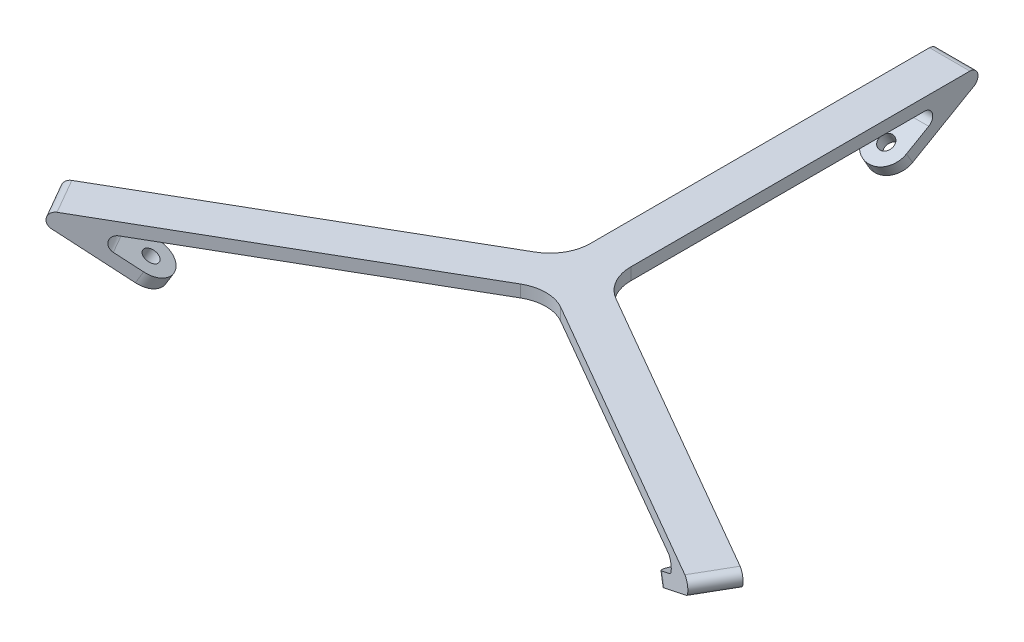
ISO-10303-21;
HEADER;
FILE_DESCRIPTION(('STEP AP214'),'2;1');
FILE_NAME('part.step','',(''),(''),'','','');
FILE_SCHEMA(('AUTOMOTIVE_DESIGN { 1 0 10303 214 1 1 1 1 }'));
ENDSEC;
DATA;
#1=APPLICATION_CONTEXT('core data for automotive mechanical design processes');
#2=APPLICATION_PROTOCOL_DEFINITION('international standard','automotive_design',2000,#1);
#3=PRODUCT_CONTEXT('',#1,'mechanical');
#4=PRODUCT('Part','Part','',(#3));
#5=PRODUCT_RELATED_PRODUCT_CATEGORY('part','',(#4));
#6=PRODUCT_DEFINITION_FORMATION('','',#4);
#7=PRODUCT_DEFINITION_CONTEXT('part definition',#1,'design');
#8=PRODUCT_DEFINITION('design','',#6,#7);
#9=PRODUCT_DEFINITION_SHAPE('','',#8);
#10=(LENGTH_UNIT() NAMED_UNIT(*) SI_UNIT(.MILLI.,.METRE.));
#11=(NAMED_UNIT(*) PLANE_ANGLE_UNIT() SI_UNIT($,.RADIAN.));
#12=(NAMED_UNIT(*) SI_UNIT($,.STERADIAN.) SOLID_ANGLE_UNIT());
#13=UNCERTAINTY_MEASURE_WITH_UNIT(LENGTH_MEASURE(1.E-05),#10,'distance_accuracy_value','');
#14=(GEOMETRIC_REPRESENTATION_CONTEXT(3) GLOBAL_UNCERTAINTY_ASSIGNED_CONTEXT((#13)) GLOBAL_UNIT_ASSIGNED_CONTEXT((#10,
#11,#12)) REPRESENTATION_CONTEXT('',''));
#15=CARTESIAN_POINT('',(0.,0.,0.));
#16=DIRECTION('',(0.,0.,1.));
#17=DIRECTION('',(1.,0.,0.));
#18=AXIS2_PLACEMENT_3D('',#15,#16,#17);
#19=CARTESIAN_POINT('',(152.180128674979,15.,-63.5837147674319));
#20=DIRECTION('',(-0.433012701892214,0.866025403784442,-0.249999999999999));
#21=DIRECTION('',(-0.894427190999919,-0.447213595499952,0.));
#22=AXIS2_PLACEMENT_3D('',#19,#20,#21);
#23=PLANE('',#22);
#24=CARTESIAN_POINT('',(67.8525403784434,2.49999999999997,39.1746824526945));
#25=DIRECTION('',(-0.433012701892214,0.866025403784442,-0.249999999999999));
#26=DIRECTION('',(-0.894427190999919,-0.447213595499952,0.));
#27=AXIS2_PLACEMENT_3D('',#24,#25,#26);
#28=CIRCLE('',#27,5.);
#29=CARTESIAN_POINT('',(65.3525403784434,2.49999999999997,43.5048094716167));
#30=VERTEX_POINT('',#29);
#31=CARTESIAN_POINT('',(64.1025403784434,0.,37.0096189432335));
#32=VERTEX_POINT('',#31);
#33=EDGE_CURVE('E380',#30,#32,#28,.F.);
#34=ORIENTED_EDGE('',*,*,#33,.T.);
#35=CARTESIAN_POINT('',(67.8525403784434,2.49999999999997,39.1746824526945));
#36=DIRECTION('',(-0.433012701892214,0.866025403784442,-0.249999999999999));
#37=DIRECTION('',(-0.894427190999919,-0.447213595499952,0.));
#38=AXIS2_PLACEMENT_3D('',#35,#36,#37);
#39=CIRCLE('',#38,5.);
#40=CARTESIAN_POINT('',(70.3525403784434,2.49999999999997,34.8445554337723));
#41=VERTEX_POINT('',#40);
#42=EDGE_CURVE('E383',#32,#41,#39,.F.);
#43=ORIENTED_EDGE('',*,*,#42,.T.);
#44=DIRECTION('',(0.750000000000001,0.499999999999995,0.433012701892224));
#45=VECTOR('',#44,1.);
#46=CARTESIAN_POINT('',(89.1025403784437,15.,45.6698729810781));
#47=LINE('',#46,#45);
#48=CARTESIAN_POINT('',(83.5044641670903,11.2679491924311,42.4378221735091));
#49=VERTEX_POINT('',#48);
#50=EDGE_CURVE('E504',#41,#49,#47,.T.);
#51=ORIENTED_EDGE('',*,*,#50,.T.);
#52=DIRECTION('',(0.500000000000004,0.,-0.866025403784436));
#53=VECTOR('',#52,1.);
#54=CARTESIAN_POINT('',(146.582052463626,11.2679491924311,-66.8157655750008));
#55=LINE('',#54,#53);
#56=CARTESIAN_POINT('',(78.5044641670903,11.2679491924311,51.0980762113535));
#57=VERTEX_POINT('',#56);
#58=EDGE_CURVE('E308',#49,#57,#55,.F.);
#59=ORIENTED_EDGE('',*,*,#58,.T.);
#60=DIRECTION('',(-0.750000000000001,-0.499999999999995,-0.433012701892224));
#61=VECTOR('',#60,1.);
#62=CARTESIAN_POINT('',(84.1025403784436,15.,54.3301270189225));
#63=LINE('',#62,#61);
#64=EDGE_CURVE('E509',#57,#30,#63,.T.);
#65=ORIENTED_EDGE('',*,*,#64,.T.);
#66=EDGE_LOOP('',(#34,#43,#51,#59,#65));
#67=FACE_BOUND('',#66,.T.);
#68=CARTESIAN_POINT('',(67.8525403784434,2.49999999999999,39.1746824526946));
#69=DIRECTION('',(0.433012701892214,-0.866025403784442,0.249999999999999));
#70=DIRECTION('',(0.894427190999919,0.447213595499952,0.));
#71=AXIS2_PLACEMENT_3D('',#68,#69,#70);
#72=CIRCLE('',#71,1.79999999999998);
#73=CARTESIAN_POINT('',(69.4625093222432,3.3049844718999,39.1746824526946));
#74=VERTEX_POINT('',#73);
#75=EDGE_CURVE('E536',#74,#74,#72,.T.);
#76=ORIENTED_EDGE('',*,*,#75,.F.);
#77=EDGE_LOOP('',(#76));
#78=FACE_BOUND('',#77,.T.);
#79=ADVANCED_FACE('F45',(#67,#78),#23,.F.);
#80=CARTESIAN_POINT('',(4.99999999999988,15.,-100.));
#81=DIRECTION('',(-1.,0.,0.));
#82=DIRECTION('',(0.,0.,1.));
#83=AXIS2_PLACEMENT_3D('',#80,#81,#82);
#84=PLANE('',#83);
#85=DIRECTION('',(0.,0.499999999999995,-0.866025403784442));
#86=VECTOR('',#85,1.);
#87=CARTESIAN_POINT('',(4.99999999999987,12.,-88.8038475772932));
#88=LINE('',#87,#86);
#89=CARTESIAN_POINT('',(4.99999999999987,5.09807621135329,-76.8493649053887));
#90=VERTEX_POINT('',#89);
#91=CARTESIAN_POINT('',(4.99999999999987,8.26794919243112,-82.3397459621553));
#92=VERTEX_POINT('',#91);
#93=EDGE_CURVE('E255',#90,#92,#88,.T.);
#94=ORIENTED_EDGE('',*,*,#93,.F.);
#95=DIRECTION('',(0.,0.866025403784439,0.5));
#96=VECTOR('',#95,1.);
#97=CARTESIAN_POINT('',(4.99999999999988,2.49999999999985,-78.3493649053887));
#98=LINE('',#97,#96);
#99=CARTESIAN_POINT('',(4.99999999999987,2.49999999999998,-78.3493649053887));
#100=VERTEX_POINT('',#99);
#101=EDGE_CURVE('E11',#90,#100,#98,.F.);
#102=ORIENTED_EDGE('',*,*,#101,.T.);
#103=DIRECTION('',(0.,-0.499999999999995,0.866025403784441));
#104=VECTOR('',#103,1.);
#105=CARTESIAN_POINT('',(4.99999999999987,15.,-100.));
#106=LINE('',#105,#104);
#107=CARTESIAN_POINT('',(4.99999999999987,11.2679491924311,-93.5358983848621));
#108=VERTEX_POINT('',#107);
#109=EDGE_CURVE('E454',#108,#100,#106,.T.);
#110=ORIENTED_EDGE('',*,*,#109,.F.);
#111=CARTESIAN_POINT('',(4.99999999999988,13.,-92.5358983848621));
#112=DIRECTION('',(-1.,0.,0.));
#113=DIRECTION('',(0.,0.,1.));
#114=AXIS2_PLACEMENT_3D('',#111,#112,#113);
#115=CIRCLE('',#114,2.);
#116=CARTESIAN_POINT('',(4.99999999999988,15.,-92.5358983848621));
#117=VERTEX_POINT('',#116);
#118=EDGE_CURVE('E300',#108,#117,#115,.F.);
#119=ORIENTED_EDGE('',*,*,#118,.T.);
#120=DIRECTION('',(0.,0.,-1.));
#121=VECTOR('',#120,1.);
#122=CARTESIAN_POINT('',(4.99999999999988,15.,-100.));
#123=LINE('',#122,#121);
#124=CARTESIAN_POINT('',(4.99999999999987,15.,-8.66025403784455));
#125=VERTEX_POINT('',#124);
#126=EDGE_CURVE('E254',#125,#117,#123,.T.);
#127=ORIENTED_EDGE('',*,*,#126,.F.);
#128=DIRECTION('',(0.,-1.,0.));
#129=VECTOR('',#128,1.);
#130=CARTESIAN_POINT('',(4.99999999999987,12.,-8.66025403784455));
#131=LINE('',#130,#129);
#132=CARTESIAN_POINT('',(4.99999999999987,12.,-8.66025403784455));
#133=VERTEX_POINT('',#132);
#134=EDGE_CURVE('E252',#125,#133,#131,.T.);
#135=ORIENTED_EDGE('',*,*,#134,.T.);
#136=DIRECTION('',(0.,0.,1.));
#137=VECTOR('',#136,1.);
#138=CARTESIAN_POINT('',(4.99999999999987,12.,0.));
#139=LINE('',#138,#137);
#140=CARTESIAN_POINT('',(4.99999999999987,12.,-81.3397459621554));
#141=VERTEX_POINT('',#140);
#142=EDGE_CURVE('E240',#141,#133,#139,.T.);
#143=ORIENTED_EDGE('',*,*,#142,.F.);
#144=CARTESIAN_POINT('',(4.99999999999988,10.,-81.3397459621554));
#145=DIRECTION('',(-1.,0.,0.));
#146=DIRECTION('',(0.,0.,1.));
#147=AXIS2_PLACEMENT_3D('',#144,#145,#146);
#148=CIRCLE('',#147,2.);
#149=EDGE_CURVE('E224',#141,#92,#148,.T.);
#150=ORIENTED_EDGE('',*,*,#149,.T.);
#151=EDGE_LOOP('',(#94,#102,#110,#119,#127,#135,#143,#150));
#152=FACE_BOUND('',#151,.T.);
#153=ADVANCED_FACE('F249',(#152),#84,.F.);
#154=CARTESIAN_POINT('',(-5.00000000000013,15.,-2.88675134594818));
#155=DIRECTION('',(1.,0.,0.));
#156=DIRECTION('',(0.,0.,-1.));
#157=AXIS2_PLACEMENT_3D('',#154,#155,#156);
#158=PLANE('',#157);
#159=DIRECTION('',(0.,0.499999999999995,-0.866025403784442));
#160=VECTOR('',#159,1.);
#161=CARTESIAN_POINT('',(-5.00000000000012,15.,-100.));
#162=LINE('',#161,#160);
#163=CARTESIAN_POINT('',(-5.00000000000012,2.49999999999997,-78.3493649053887));
#164=VERTEX_POINT('',#163);
#165=CARTESIAN_POINT('',(-5.00000000000012,11.2679491924311,-93.5358983848621));
#166=VERTEX_POINT('',#165);
#167=EDGE_CURVE('E461',#164,#166,#162,.T.);
#168=ORIENTED_EDGE('',*,*,#167,.F.);
#169=DIRECTION('',(0.,-0.866025403784439,-0.5));
#170=VECTOR('',#169,1.);
#171=CARTESIAN_POINT('',(-5.00000000000012,44.5512701892217,-54.0710527418758));
#172=LINE('',#171,#170);
#173=CARTESIAN_POINT('',(-5.00000000000012,5.09807621135329,-76.8493649053887));
#174=VERTEX_POINT('',#173);
#175=EDGE_CURVE('E424',#164,#174,#172,.F.);
#176=ORIENTED_EDGE('',*,*,#175,.T.);
#177=DIRECTION('',(0.,-0.499999999999995,0.866025403784442));
#178=VECTOR('',#177,1.);
#179=CARTESIAN_POINT('',(-5.00000000000012,12.,-88.8038475772932));
#180=LINE('',#179,#178);
#181=CARTESIAN_POINT('',(-5.00000000000012,8.26794919243111,-82.3397459621553));
#182=VERTEX_POINT('',#181);
#183=EDGE_CURVE('E460',#182,#174,#180,.T.);
#184=ORIENTED_EDGE('',*,*,#183,.F.);
#185=CARTESIAN_POINT('',(-5.00000000000012,10.,-81.3397459621554));
#186=DIRECTION('',(1.,0.,0.));
#187=DIRECTION('',(0.,0.,-1.));
#188=AXIS2_PLACEMENT_3D('',#185,#186,#187);
#189=CIRCLE('',#188,2.);
#190=CARTESIAN_POINT('',(-5.00000000000012,12.,-81.3397459621554));
#191=VERTEX_POINT('',#190);
#192=EDGE_CURVE('E233',#182,#191,#189,.T.);
#193=ORIENTED_EDGE('',*,*,#192,.T.);
#194=DIRECTION('',(0.,0.,-1.));
#195=VECTOR('',#194,1.);
#196=CARTESIAN_POINT('',(-5.00000000000013,12.,0.));
#197=LINE('',#196,#195);
#198=CARTESIAN_POINT('',(-5.00000000000013,12.,-8.66025403784427));
#199=VERTEX_POINT('',#198);
#200=EDGE_CURVE('E242',#199,#191,#197,.T.);
#201=ORIENTED_EDGE('',*,*,#200,.F.);
#202=DIRECTION('',(0.,-1.,0.));
#203=VECTOR('',#202,1.);
#204=CARTESIAN_POINT('',(-5.00000000000013,15.,-8.66025403784427));
#205=LINE('',#204,#203);
#206=CARTESIAN_POINT('',(-5.00000000000013,15.,-8.66025403784427));
#207=VERTEX_POINT('',#206);
#208=EDGE_CURVE('E352',#199,#207,#205,.F.);
#209=ORIENTED_EDGE('',*,*,#208,.T.);
#210=DIRECTION('',(0.,0.,1.));
#211=VECTOR('',#210,1.);
#212=CARTESIAN_POINT('',(-5.00000000000013,15.,-2.88675134594818));
#213=LINE('',#212,#211);
#214=CARTESIAN_POINT('',(-5.00000000000012,15.,-92.5358983848621));
#215=VERTEX_POINT('',#214);
#216=EDGE_CURVE('E246',#215,#207,#213,.T.);
#217=ORIENTED_EDGE('',*,*,#216,.F.);
#218=CARTESIAN_POINT('',(-5.00000000000012,13.,-92.5358983848621));
#219=DIRECTION('',(1.,0.,0.));
#220=DIRECTION('',(0.,0.,-1.));
#221=AXIS2_PLACEMENT_3D('',#218,#219,#220);
#222=CIRCLE('',#221,2.);
#223=EDGE_CURVE('E293',#215,#166,#222,.F.);
#224=ORIENTED_EDGE('',*,*,#223,.T.);
#225=EDGE_LOOP('',(#168,#176,#184,#193,#201,#209,#217,#224));
#226=FACE_BOUND('',#225,.T.);
#227=ADVANCED_FACE('F611',(#226),#158,.F.);
#228=CARTESIAN_POINT('',(0.,15.,0.));
#229=DIRECTION('',(0.,-1.,0.));
#230=DIRECTION('',(0.,0.,-1.));
#231=AXIS2_PLACEMENT_3D('',#228,#229,#230);
#232=PLANE('',#231);
#233=DIRECTION('',(-0.866025403784436,0.,-0.500000000000004));
#234=VECTOR('',#233,1.);
#235=CARTESIAN_POINT('',(5.00000000000012,15.,-2.88675134594819));
#236=LINE('',#235,#234);
#237=CARTESIAN_POINT('',(82.6384387633059,15.,41.9378221735091));
#238=VERTEX_POINT('',#237);
#239=CARTESIAN_POINT('',(9.99999999999984,15.,-1.92120624964431E-13));
#240=VERTEX_POINT('',#239);
#241=EDGE_CURVE('E477',#238,#240,#236,.T.);
#242=ORIENTED_EDGE('',*,*,#241,.T.);
#243=CARTESIAN_POINT('',(14.9999999999999,15.,-8.66025403784455));
#244=DIRECTION('',(0.,-1.,0.));
#245=DIRECTION('',(0.,0.,-1.));
#246=AXIS2_PLACEMENT_3D('',#243,#244,#245);
#247=CIRCLE('',#246,10.);
#248=EDGE_CURVE('E365',#240,#125,#247,.T.);
#249=ORIENTED_EDGE('',*,*,#248,.T.);
#250=ORIENTED_EDGE('',*,*,#126,.T.);
#251=DIRECTION('',(-1.,0.,0.));
#252=VECTOR('',#251,1.);
#253=CARTESIAN_POINT('',(0.,15.,-92.5358983848621));
#254=LINE('',#253,#252);
#255=EDGE_CURVE('E289',#117,#215,#254,.T.);
#256=ORIENTED_EDGE('',*,*,#255,.T.);
#257=ORIENTED_EDGE('',*,*,#216,.T.);
#258=CARTESIAN_POINT('',(-15.0000000000001,15.,-8.66025403784427));
#259=DIRECTION('',(0.,-1.,0.));
#260=DIRECTION('',(0.,0.,-1.));
#261=AXIS2_PLACEMENT_3D('',#258,#259,#260);
#262=CIRCLE('',#261,10.);
#263=CARTESIAN_POINT('',(-10.0000000000002,15.,1.73472347597681E-13));
#264=VERTEX_POINT('',#263);
#265=EDGE_CURVE('E371',#207,#264,#262,.T.);
#266=ORIENTED_EDGE('',*,*,#265,.T.);
#267=DIRECTION('',(-0.866025403784443,0.,0.499999999999992));
#268=VECTOR('',#267,1.);
#269=CARTESIAN_POINT('',(-89.1025403784442,15.,45.6698729810771));
#270=LINE('',#269,#268);
#271=CARTESIAN_POINT('',(-82.6384387633063,15.,41.9378221735082));
#272=VERTEX_POINT('',#271);
#273=EDGE_CURVE('E488',#264,#272,#270,.T.);
#274=ORIENTED_EDGE('',*,*,#273,.T.);
#275=DIRECTION('',(0.499999999999992,0.,0.866025403784443));
#276=VECTOR('',#275,1.);
#277=CARTESIAN_POINT('',(-80.1384387633064,15.,46.2679491924303));
#278=LINE('',#277,#276);
#279=CARTESIAN_POINT('',(-77.6384387633064,15.,50.5980762113526));
#280=VERTEX_POINT('',#279);
#281=EDGE_CURVE('E281',#272,#280,#278,.T.);
#282=ORIENTED_EDGE('',*,*,#281,.T.);
#283=DIRECTION('',(0.866025403784443,0.,-0.499999999999992));
#284=VECTOR('',#283,1.);
#285=CARTESIAN_POINT('',(0.,15.,5.77350269189639));
#286=LINE('',#285,#284);
#287=CARTESIAN_POINT('',(-4.99999999999979,15.,8.66025403784432));
#288=VERTEX_POINT('',#287);
#289=EDGE_CURVE('E484',#280,#288,#286,.T.);
#290=ORIENTED_EDGE('',*,*,#289,.T.);
#291=CARTESIAN_POINT('',(1.2490009027033E-13,15.,17.3205080756888));
#292=DIRECTION('',(0.,-1.,0.));
#293=DIRECTION('',(0.,0.,-1.));
#294=AXIS2_PLACEMENT_3D('',#291,#292,#293);
#295=CIRCLE('',#294,10.);
#296=CARTESIAN_POINT('',(5.00000000000014,15.,8.66025403784437));
#297=VERTEX_POINT('',#296);
#298=EDGE_CURVE('E377',#288,#297,#295,.T.);
#299=ORIENTED_EDGE('',*,*,#298,.T.);
#300=DIRECTION('',(0.866025403784436,0.,0.500000000000004));
#301=VECTOR('',#300,1.);
#302=CARTESIAN_POINT('',(84.1025403784436,15.,54.3301270189225));
#303=LINE('',#302,#301);
#304=CARTESIAN_POINT('',(77.6384387633058,15.,50.5980762113535));
#305=VERTEX_POINT('',#304);
#306=EDGE_CURVE('E481',#297,#305,#303,.T.);
#307=ORIENTED_EDGE('',*,*,#306,.T.);
#308=DIRECTION('',(0.500000000000004,0.,-0.866025403784436));
#309=VECTOR('',#308,1.);
#310=CARTESIAN_POINT('',(80.1384387633058,15.,46.2679491924314));
#311=LINE('',#310,#309);
#312=EDGE_CURVE('E285',#305,#238,#311,.T.);
#313=ORIENTED_EDGE('',*,*,#312,.T.);
#314=EDGE_LOOP('',(#242,#249,#250,#256,#257,#266,#274,#282,#290,#299,#307,#313));
#315=FACE_BOUND('',#314,.T.);
#316=ADVANCED_FACE('F584',(#315),#232,.F.);
#317=CARTESIAN_POINT('',(-5.00100000000013,12.,0.));
#318=DIRECTION('',(0.,1.,0.));
#319=DIRECTION('',(0.,0.,1.));
#320=AXIS2_PLACEMENT_3D('',#317,#318,#319);
#321=PLANE('',#320);
#322=DIRECTION('',(-0.866025403784436,0.,-0.500000000000004));
#323=VECTOR('',#322,1.);
#324=CARTESIAN_POINT('',(-2.49999999999996,12.,4.33012701892207));
#325=LINE('',#324,#323);
#326=CARTESIAN_POINT('',(67.9422863405992,12.,45.0000000000001));
#327=VERTEX_POINT('',#326);
#328=CARTESIAN_POINT('',(5.00000000000017,12.,8.66025403784439));
#329=VERTEX_POINT('',#328);
#330=EDGE_CURVE('E491',#327,#329,#325,.T.);
#331=ORIENTED_EDGE('',*,*,#330,.T.);
#332=CARTESIAN_POINT('',(1.2490009027033E-13,12.,17.3205080756888));
#333=DIRECTION('',(0.,1.,0.));
#334=DIRECTION('',(0.,0.,1.));
#335=AXIS2_PLACEMENT_3D('',#332,#333,#334);
#336=CIRCLE('',#335,10.);
#337=CARTESIAN_POINT('',(-4.9999999999998,12.,8.66025403784431));
#338=VERTEX_POINT('',#337);
#339=EDGE_CURVE('E374',#329,#338,#336,.T.);
#340=ORIENTED_EDGE('',*,*,#339,.T.);
#341=DIRECTION('',(-0.866025403784443,0.,0.499999999999992));
#342=VECTOR('',#341,1.);
#343=CARTESIAN_POINT('',(2.50000000000003,12.,4.33012701892231));
#344=LINE('',#343,#342);
#345=CARTESIAN_POINT('',(-67.9422863405996,12.,44.9999999999993));
#346=VERTEX_POINT('',#345);
#347=EDGE_CURVE('E513',#338,#346,#344,.T.);
#348=ORIENTED_EDGE('',*,*,#347,.T.);
#349=DIRECTION('',(-0.499999999999992,0.,-0.866025403784443));
#350=VECTOR('',#349,1.);
#351=CARTESIAN_POINT('',(-72.9422863405995,12.,36.3397459621549));
#352=LINE('',#351,#350);
#353=CARTESIAN_POINT('',(-72.9422863405995,12.,36.3397459621549));
#354=VERTEX_POINT('',#353);
#355=EDGE_CURVE('E269',#346,#354,#352,.T.);
#356=ORIENTED_EDGE('',*,*,#355,.T.);
#357=DIRECTION('',(0.866025403784443,0.,-0.499999999999992));
#358=VECTOR('',#357,1.);
#359=CARTESIAN_POINT('',(-2.4999999999999,12.,-4.33012701892211));
#360=LINE('',#359,#358);
#361=CARTESIAN_POINT('',(-10.0000000000002,12.,1.75207071073658E-13));
#362=VERTEX_POINT('',#361);
#363=EDGE_CURVE('E505',#354,#362,#360,.T.);
#364=ORIENTED_EDGE('',*,*,#363,.T.);
#365=CARTESIAN_POINT('',(-15.0000000000001,12.,-8.66025403784427));
#366=DIRECTION('',(0.,1.,0.));
#367=DIRECTION('',(0.,0.,1.));
#368=AXIS2_PLACEMENT_3D('',#365,#366,#367);
#369=CIRCLE('',#368,10.);
#370=EDGE_CURVE('E368',#362,#199,#369,.T.);
#371=ORIENTED_EDGE('',*,*,#370,.T.);
#372=ORIENTED_EDGE('',*,*,#200,.T.);
#373=DIRECTION('',(1.,0.,0.));
#374=VECTOR('',#373,1.);
#375=CARTESIAN_POINT('',(4.99999999999987,12.,-81.3397459621554));
#376=LINE('',#375,#374);
#377=EDGE_CURVE('E228',#191,#141,#376,.T.);
#378=ORIENTED_EDGE('',*,*,#377,.T.);
#379=ORIENTED_EDGE('',*,*,#142,.T.);
#380=CARTESIAN_POINT('',(14.9999999999999,12.,-8.66025403784455));
#381=DIRECTION('',(0.,1.,0.));
#382=DIRECTION('',(0.,0.,1.));
#383=AXIS2_PLACEMENT_3D('',#380,#381,#382);
#384=CIRCLE('',#383,10.);
#385=CARTESIAN_POINT('',(9.99999999999984,12.,-1.87350135405495E-13));
#386=VERTEX_POINT('',#385);
#387=EDGE_CURVE('E362',#133,#386,#384,.T.);
#388=ORIENTED_EDGE('',*,*,#387,.T.);
#389=DIRECTION('',(0.866025403784436,0.,0.500000000000004));
#390=VECTOR('',#389,1.);
#391=CARTESIAN_POINT('',(2.50000000000009,12.,-4.33012701892228));
#392=LINE('',#391,#390);
#393=CARTESIAN_POINT('',(72.9422863405992,12.,36.3397459621557));
#394=VERTEX_POINT('',#393);
#395=EDGE_CURVE('E497',#386,#394,#392,.T.);
#396=ORIENTED_EDGE('',*,*,#395,.T.);
#397=DIRECTION('',(-0.500000000000004,0.,0.866025403784436));
#398=VECTOR('',#397,1.);
#399=CARTESIAN_POINT('',(67.9422863405991,12.,45.0000000000001));
#400=LINE('',#399,#398);
#401=EDGE_CURVE('E245',#394,#327,#400,.T.);
#402=ORIENTED_EDGE('',*,*,#401,.T.);
#403=EDGE_LOOP('',(#331,#340,#348,#356,#364,#371,#372,#378,#379,#388,#396,#402));
#404=FACE_BOUND('',#403,.T.);
#405=ADVANCED_FACE('F239',(#404),#321,.F.);
#406=CARTESIAN_POINT('',(-5.00100000000013,12.,-88.8038475772932));
#407=DIRECTION('',(0.,-0.866025403784442,-0.499999999999995));
#408=DIRECTION('',(0.,0.499999999999995,-0.866025403784442));
#409=AXIS2_PLACEMENT_3D('',#406,#407,#408);
#410=PLANE('',#409);
#411=CARTESIAN_POINT('',(0.,5.0980762113533,-76.8493649053887));
#412=DIRECTION('',(0.,-0.866025403784442,-0.499999999999995));
#413=DIRECTION('',(0.,0.499999999999995,-0.866025403784442));
#414=AXIS2_PLACEMENT_3D('',#411,#412,#413);
#415=CIRCLE('',#414,1.79999999999999);
#416=CARTESIAN_POINT('',(0.,5.99807621135329,-78.4082106322007));
#417=VERTEX_POINT('',#416);
#418=EDGE_CURVE('E466',#417,#417,#415,.T.);
#419=ORIENTED_EDGE('',*,*,#418,.T.);
#420=EDGE_LOOP('',(#419));
#421=FACE_BOUND('',#420,.T.);
#422=ORIENTED_EDGE('',*,*,#183,.T.);
#423=CARTESIAN_POINT('',(-1.24032728532342E-13,5.09807621135329,-76.8493649053887));
#424=DIRECTION('',(0.,-0.866025403784442,-0.499999999999995));
#425=DIRECTION('',(0.,0.499999999999995,-0.866025403784442));
#426=AXIS2_PLACEMENT_3D('',#423,#424,#425);
#427=CIRCLE('',#426,5.);
#428=CARTESIAN_POINT('',(-1.24032728532342E-13,2.59807621135334,-72.5192378864664));
#429=VERTEX_POINT('',#428);
#430=EDGE_CURVE('E55',#174,#429,#427,.F.);
#431=ORIENTED_EDGE('',*,*,#430,.T.);
#432=CARTESIAN_POINT('',(-1.24032728532342E-13,5.09807621135329,-76.8493649053887));
#433=DIRECTION('',(0.,-0.866025403784442,-0.499999999999995));
#434=DIRECTION('',(0.,0.499999999999995,-0.866025403784442));
#435=AXIS2_PLACEMENT_3D('',#432,#433,#434);
#436=CIRCLE('',#435,5.);
#437=EDGE_CURVE('E66',#429,#90,#436,.F.);
#438=ORIENTED_EDGE('',*,*,#437,.T.);
#439=ORIENTED_EDGE('',*,*,#93,.T.);
#440=DIRECTION('',(1.,0.,0.));
#441=VECTOR('',#440,1.);
#442=CARTESIAN_POINT('',(-5.00000000000012,8.26794919243112,-82.3397459621553));
#443=LINE('',#442,#441);
#444=EDGE_CURVE('E229',#92,#182,#443,.F.);
#445=ORIENTED_EDGE('',*,*,#444,.T.);
#446=EDGE_LOOP('',(#422,#431,#438,#439,#445));
#447=FACE_BOUND('',#446,.T.);
#448=ADVANCED_FACE('F666',(#421,#447),#410,.F.);
#449=CARTESIAN_POINT('',(-5.00100000000013,15.,-100.));
#450=DIRECTION('',(0.,0.866025403784442,0.499999999999995));
#451=DIRECTION('',(0.,-0.499999999999995,0.866025403784442));
#452=AXIS2_PLACEMENT_3D('',#449,#450,#451);
#453=PLANE('',#452);
#454=CARTESIAN_POINT('',(0.,2.49999999999999,-78.3493649053887));
#455=DIRECTION('',(0.,-0.866025403784442,-0.499999999999995));
#456=DIRECTION('',(0.,0.499999999999995,-0.866025403784442));
#457=AXIS2_PLACEMENT_3D('',#454,#455,#456);
#458=CIRCLE('',#457,1.79999999999999);
#459=CARTESIAN_POINT('',(0.,3.39999999999997,-79.9082106322006));
#460=VERTEX_POINT('',#459);
#461=EDGE_CURVE('E473',#460,#460,#458,.T.);
#462=ORIENTED_EDGE('',*,*,#461,.F.);
#463=EDGE_LOOP('',(#462));
#464=FACE_BOUND('',#463,.T.);
#465=CARTESIAN_POINT('',(-1.23992537025261E-13,2.49999999999998,-78.3493649053887));
#466=DIRECTION('',(0.,0.866025403784442,0.499999999999995));
#467=DIRECTION('',(0.,-0.499999999999995,0.866025403784442));
#468=AXIS2_PLACEMENT_3D('',#465,#466,#467);
#469=CIRCLE('',#468,5.);
#470=CARTESIAN_POINT('',(-1.24032728532342E-13,0.,-74.0192378864664));
#471=VERTEX_POINT('',#470);
#472=EDGE_CURVE('E418',#100,#471,#469,.F.);
#473=ORIENTED_EDGE('',*,*,#472,.T.);
#474=CARTESIAN_POINT('',(-1.23992537025261E-13,2.49999999999998,-78.3493649053887));
#475=DIRECTION('',(0.,0.866025403784442,0.499999999999995));
#476=DIRECTION('',(0.,-0.499999999999995,0.866025403784442));
#477=AXIS2_PLACEMENT_3D('',#474,#475,#476);
#478=CIRCLE('',#477,5.);
#479=EDGE_CURVE('E421',#471,#164,#478,.F.);
#480=ORIENTED_EDGE('',*,*,#479,.T.);
#481=ORIENTED_EDGE('',*,*,#167,.T.);
#482=DIRECTION('',(-1.,0.,0.));
#483=VECTOR('',#482,1.);
#484=CARTESIAN_POINT('',(-5.00100000000013,11.2679491924311,-93.5358983848621));
#485=LINE('',#484,#483);
#486=EDGE_CURVE('E297',#166,#108,#485,.F.);
#487=ORIENTED_EDGE('',*,*,#486,.T.);
#488=ORIENTED_EDGE('',*,*,#109,.T.);
#489=EDGE_LOOP('',(#473,#480,#481,#487,#488));
#490=FACE_BOUND('',#489,.T.);
#491=ADVANCED_FACE('F457',(#464,#490),#453,.F.);
#492=CARTESIAN_POINT('',(0.,2.49999999999999,-78.3493649053887));
#493=DIRECTION('',(0.,-0.866025403784442,-0.499999999999995));
#494=DIRECTION('',(0.,0.499999999999995,-0.866025403784442));
#495=AXIS2_PLACEMENT_3D('',#492,#493,#494);
#496=CYLINDRICAL_SURFACE('',#495,1.79999999999999);
#497=ORIENTED_EDGE('',*,*,#418,.F.);
#498=EDGE_LOOP('',(#497));
#499=FACE_BOUND('',#498,.T.);
#500=ORIENTED_EDGE('',*,*,#461,.T.);
#501=EDGE_LOOP('',(#500));
#502=FACE_BOUND('',#501,.T.);
#503=ADVANCED_FACE('F660',(#499,#502),#496,.F.);
#504=CARTESIAN_POINT('',(84.1025403784436,15.,54.3301270189225));
#505=DIRECTION('',(0.500000000000004,0.,-0.866025403784436));
#506=DIRECTION('',(-0.866025403784436,0.,-0.500000000000004));
#507=AXIS2_PLACEMENT_3D('',#504,#505,#506);
#508=PLANE('',#507);
#509=DIRECTION('',(0.750000000000001,0.499999999999995,0.433012701892224));
#510=VECTOR('',#509,1.);
#511=CARTESIAN_POINT('',(74.4063879557369,12.,48.732050807569));
#512=LINE('',#511,#510);
#513=CARTESIAN_POINT('',(64.0535022727667,5.09807621135328,42.7548094716167));
#514=VERTEX_POINT('',#513);
#515=CARTESIAN_POINT('',(68.8083117443835,8.26794919243112,45.5000000000001));
#516=VERTEX_POINT('',#515);
#517=EDGE_CURVE('E494',#514,#516,#512,.T.);
#518=ORIENTED_EDGE('',*,*,#517,.F.);
#519=DIRECTION('',(-0.433012701892218,0.866025403784438,-0.250000000000002));
#520=VECTOR('',#519,1.);
#521=CARTESIAN_POINT('',(65.3525403784435,2.49999999999983,43.5048094716168));
#522=LINE('',#521,#520);
#523=EDGE_CURVE('E396',#514,#30,#522,.F.);
#524=ORIENTED_EDGE('',*,*,#523,.T.);
#525=ORIENTED_EDGE('',*,*,#64,.F.);
#526=CARTESIAN_POINT('',(77.6384387633058,13.,50.5980762113535));
#527=DIRECTION('',(0.500000000000004,0.,-0.866025403784436));
#528=DIRECTION('',(-0.866025403784436,0.,-0.500000000000004));
#529=AXIS2_PLACEMENT_3D('',#526,#527,#528);
#530=CIRCLE('',#529,2.);
#531=EDGE_CURVE('E311',#57,#305,#530,.F.);
#532=ORIENTED_EDGE('',*,*,#531,.T.);
#533=ORIENTED_EDGE('',*,*,#306,.F.);
#534=DIRECTION('',(0.,-1.,0.));
#535=VECTOR('',#534,1.);
#536=CARTESIAN_POINT('',(5.00000000000017,12.,8.66025403784439));
#537=LINE('',#536,#535);
#538=EDGE_CURVE('E355',#297,#329,#537,.T.);
#539=ORIENTED_EDGE('',*,*,#538,.T.);
#540=ORIENTED_EDGE('',*,*,#330,.F.);
#541=CARTESIAN_POINT('',(67.9422863405991,10.,45.0000000000001));
#542=DIRECTION('',(0.500000000000004,0.,-0.866025403784436));
#543=DIRECTION('',(-0.866025403784436,0.,-0.500000000000004));
#544=AXIS2_PLACEMENT_3D('',#541,#542,#543);
#545=CIRCLE('',#544,2.);
#546=EDGE_CURVE('E334',#327,#516,#545,.T.);
#547=ORIENTED_EDGE('',*,*,#546,.T.);
#548=EDGE_LOOP('',(#518,#524,#525,#532,#533,#539,#540,#547));
#549=FACE_BOUND('',#548,.T.);
#550=ADVANCED_FACE('F587',(#549),#508,.F.);
#551=CARTESIAN_POINT('',(5.00000000000012,15.,-2.88675134594819));
#552=DIRECTION('',(-0.500000000000004,0.,0.866025403784436));
#553=DIRECTION('',(0.866025403784436,0.,0.500000000000004));
#554=AXIS2_PLACEMENT_3D('',#551,#552,#553);
#555=PLANE('',#554);
#556=ORIENTED_EDGE('',*,*,#50,.F.);
#557=DIRECTION('',(0.433012701892218,-0.866025403784438,0.250000000000002));
#558=VECTOR('',#557,1.);
#559=CARTESIAN_POINT('',(49.3269052838326,44.5512701892217,22.7053993520158));
#560=LINE('',#559,#558);
#561=CARTESIAN_POINT('',(69.0535022727668,5.09807621135328,34.0945554337723));
#562=VERTEX_POINT('',#561);
#563=EDGE_CURVE('E386',#41,#562,#560,.F.);
#564=ORIENTED_EDGE('',*,*,#563,.T.);
#565=DIRECTION('',(-0.750000000000001,-0.499999999999995,-0.433012701892224));
#566=VECTOR('',#565,1.);
#567=CARTESIAN_POINT('',(79.406387955737,12.,40.0717967697247));
#568=LINE('',#567,#566);
#569=CARTESIAN_POINT('',(73.8083117443836,8.26794919243112,36.8397459621557));
#570=VERTEX_POINT('',#569);
#571=EDGE_CURVE('E500',#570,#562,#568,.T.);
#572=ORIENTED_EDGE('',*,*,#571,.F.);
#573=CARTESIAN_POINT('',(72.9422863405992,10.,36.3397459621557));
#574=DIRECTION('',(-0.500000000000004,0.,0.866025403784436));
#575=DIRECTION('',(0.866025403784436,0.,0.500000000000004));
#576=AXIS2_PLACEMENT_3D('',#573,#574,#575);
#577=CIRCLE('',#576,2.);
#578=EDGE_CURVE('E234',#570,#394,#577,.T.);
#579=ORIENTED_EDGE('',*,*,#578,.T.);
#580=ORIENTED_EDGE('',*,*,#395,.F.);
#581=DIRECTION('',(0.,-1.,0.));
#582=VECTOR('',#581,1.);
#583=CARTESIAN_POINT('',(9.99999999999984,15.,-1.92178727183741E-13));
#584=LINE('',#583,#582);
#585=EDGE_CURVE('E345',#386,#240,#584,.F.);
#586=ORIENTED_EDGE('',*,*,#585,.T.);
#587=ORIENTED_EDGE('',*,*,#241,.F.);
#588=CARTESIAN_POINT('',(82.6384387633059,13.,41.9378221735091));
#589=DIRECTION('',(-0.500000000000004,0.,0.866025403784436));
#590=DIRECTION('',(0.866025403784436,0.,0.500000000000004));
#591=AXIS2_PLACEMENT_3D('',#588,#589,#590);
#592=CIRCLE('',#591,2.);
#593=EDGE_CURVE('E304',#238,#49,#592,.F.);
#594=ORIENTED_EDGE('',*,*,#593,.T.);
#595=EDGE_LOOP('',(#556,#564,#572,#579,#580,#586,#587,#594));
#596=FACE_BOUND('',#595,.T.);
#597=ADVANCED_FACE('F599',(#596),#555,.F.);
#598=CARTESIAN_POINT('',(-89.1025403784442,15.,45.6698729810771));
#599=DIRECTION('',(0.499999999999992,0.,0.866025403784443));
#600=DIRECTION('',(0.866025403784443,0.,-0.499999999999992));
#601=AXIS2_PLACEMENT_3D('',#598,#599,#600);
#602=PLANE('',#601);
#603=DIRECTION('',(-0.750000000000007,0.499999999999995,0.433012701892214));
#604=VECTOR('',#603,1.);
#605=CARTESIAN_POINT('',(-79.4063879557374,12.,40.0717967697238));
#606=LINE('',#605,#604);
#607=CARTESIAN_POINT('',(-69.0535022727671,5.09807621135329,34.0945554337716));
#608=VERTEX_POINT('',#607);
#609=CARTESIAN_POINT('',(-73.8083117443839,8.26794919243111,36.8397459621549));
#610=VERTEX_POINT('',#609);
#611=EDGE_CURVE('E510',#608,#610,#606,.T.);
#612=ORIENTED_EDGE('',*,*,#611,.F.);
#613=DIRECTION('',(0.433012701892222,0.866025403784439,-0.249999999999996));
#614=VECTOR('',#613,1.);
#615=CARTESIAN_POINT('',(-70.3525403784439,2.49999999999984,34.8445554337716));
#616=LINE('',#615,#614);
#617=CARTESIAN_POINT('',(-70.3525403784438,2.49999999999998,34.8445554337716));
#618=VERTEX_POINT('',#617);
#619=EDGE_CURVE('E415',#608,#618,#616,.F.);
#620=ORIENTED_EDGE('',*,*,#619,.T.);
#621=DIRECTION('',(0.750000000000006,-0.499999999999995,-0.433012701892214));
#622=VECTOR('',#621,1.);
#623=CARTESIAN_POINT('',(-89.1025403784442,15.,45.6698729810771));
#624=LINE('',#623,#622);
#625=CARTESIAN_POINT('',(-83.5044641670908,11.2679491924311,42.4378221735082));
#626=VERTEX_POINT('',#625);
#627=EDGE_CURVE('E528',#626,#618,#624,.T.);
#628=ORIENTED_EDGE('',*,*,#627,.F.);
#629=CARTESIAN_POINT('',(-82.6384387633063,13.,41.9378221735082));
#630=DIRECTION('',(0.499999999999992,0.,0.866025403784443));
#631=DIRECTION('',(0.866025403784443,0.,-0.499999999999992));
#632=AXIS2_PLACEMENT_3D('',#629,#630,#631);
#633=CIRCLE('',#632,2.);
#634=EDGE_CURVE('E322',#626,#272,#633,.F.);
#635=ORIENTED_EDGE('',*,*,#634,.T.);
#636=ORIENTED_EDGE('',*,*,#273,.F.);
#637=DIRECTION('',(0.,-1.,0.));
#638=VECTOR('',#637,1.);
#639=CARTESIAN_POINT('',(-10.0000000000002,12.,1.66533453693773E-13));
#640=LINE('',#639,#638);
#641=EDGE_CURVE('E348',#264,#362,#640,.T.);
#642=ORIENTED_EDGE('',*,*,#641,.T.);
#643=ORIENTED_EDGE('',*,*,#363,.F.);
#644=CARTESIAN_POINT('',(-72.9422863405995,10.,36.3397459621549));
#645=DIRECTION('',(0.499999999999992,0.,0.866025403784443));
#646=DIRECTION('',(0.866025403784443,0.,-0.499999999999992));
#647=AXIS2_PLACEMENT_3D('',#644,#645,#646);
#648=CIRCLE('',#647,2.);
#649=EDGE_CURVE('E326',#354,#610,#648,.T.);
#650=ORIENTED_EDGE('',*,*,#649,.T.);
#651=EDGE_LOOP('',(#612,#620,#628,#635,#636,#642,#643,#650));
#652=FACE_BOUND('',#651,.T.);
#653=ADVANCED_FACE('F618',(#652),#602,.F.);
#654=CARTESIAN_POINT('',(0.,15.,5.77350269189639));
#655=DIRECTION('',(-0.499999999999992,0.,-0.866025403784443));
#656=DIRECTION('',(-0.866025403784443,0.,0.499999999999992));
#657=AXIS2_PLACEMENT_3D('',#654,#655,#656);
#658=PLANE('',#657);
#659=DIRECTION('',(-0.750000000000007,0.499999999999995,0.433012701892214));
#660=VECTOR('',#659,1.);
#661=CARTESIAN_POINT('',(-84.1025403784443,15.,54.3301270189215));
#662=LINE('',#661,#660);
#663=CARTESIAN_POINT('',(-65.3525403784439,2.49999999999997,43.504809471616));
#664=VERTEX_POINT('',#663);
#665=CARTESIAN_POINT('',(-78.5044641670908,11.2679491924311,51.0980762113526));
#666=VERTEX_POINT('',#665);
#667=EDGE_CURVE('E520',#664,#666,#662,.T.);
#668=ORIENTED_EDGE('',*,*,#667,.F.);
#669=DIRECTION('',(-0.433012701892222,-0.866025403784439,0.249999999999996));
#670=VECTOR('',#669,1.);
#671=CARTESIAN_POINT('',(-44.3269052838329,44.5512701892217,31.3656533898598));
#672=LINE('',#671,#670);
#673=CARTESIAN_POINT('',(-64.0535022727672,5.0980762113533,42.754809471616));
#674=VERTEX_POINT('',#673);
#675=EDGE_CURVE('E405',#664,#674,#672,.F.);
#676=ORIENTED_EDGE('',*,*,#675,.T.);
#677=DIRECTION('',(0.750000000000007,-0.499999999999995,-0.433012701892214));
#678=VECTOR('',#677,1.);
#679=CARTESIAN_POINT('',(-74.4063879557375,12.,48.7320508075682));
#680=LINE('',#679,#678);
#681=CARTESIAN_POINT('',(-68.808311744384,8.26794919243111,45.4999999999993));
#682=VERTEX_POINT('',#681);
#683=EDGE_CURVE('E516',#682,#674,#680,.T.);
#684=ORIENTED_EDGE('',*,*,#683,.F.);
#685=CARTESIAN_POINT('',(-67.9422863405996,10.,44.9999999999993));
#686=DIRECTION('',(-0.499999999999992,0.,-0.866025403784443));
#687=DIRECTION('',(-0.866025403784443,0.,0.499999999999992));
#688=AXIS2_PLACEMENT_3D('',#685,#686,#687);
#689=CIRCLE('',#688,2.);
#690=EDGE_CURVE('E330',#682,#346,#689,.T.);
#691=ORIENTED_EDGE('',*,*,#690,.T.);
#692=ORIENTED_EDGE('',*,*,#347,.F.);
#693=DIRECTION('',(0.,-1.,0.));
#694=VECTOR('',#693,1.);
#695=CARTESIAN_POINT('',(-4.99999999999979,15.,8.66025403784432));
#696=LINE('',#695,#694);
#697=EDGE_CURVE('E359',#338,#288,#696,.F.);
#698=ORIENTED_EDGE('',*,*,#697,.T.);
#699=ORIENTED_EDGE('',*,*,#289,.F.);
#700=CARTESIAN_POINT('',(-77.6384387633064,13.,50.5980762113526));
#701=DIRECTION('',(-0.499999999999992,0.,-0.866025403784443));
#702=DIRECTION('',(-0.866025403784443,0.,0.499999999999992));
#703=AXIS2_PLACEMENT_3D('',#700,#701,#702);
#704=CIRCLE('',#703,2.);
#705=EDGE_CURVE('E315',#280,#666,#704,.F.);
#706=ORIENTED_EDGE('',*,*,#705,.T.);
#707=EDGE_LOOP('',(#668,#676,#684,#691,#692,#698,#699,#706));
#708=FACE_BOUND('',#707,.T.);
#709=ADVANCED_FACE('F567',(#708),#658,.F.);
#710=CARTESIAN_POINT('',(142.483976252272,12.,-69.1817909787853));
#711=DIRECTION('',(0.433012701892214,-0.866025403784442,0.249999999999999));
#712=DIRECTION('',(0.894427190999919,0.447213595499952,0.));
#713=AXIS2_PLACEMENT_3D('',#710,#711,#712);
#714=PLANE('',#713);
#715=CARTESIAN_POINT('',(66.5535022727668,5.0980762113533,38.4246824526946));
#716=DIRECTION('',(0.433012701892214,-0.866025403784442,0.249999999999999));
#717=DIRECTION('',(0.894427190999919,0.447213595499952,0.));
#718=AXIS2_PLACEMENT_3D('',#715,#716,#717);
#719=CIRCLE('',#718,1.79999999999999);
#720=CARTESIAN_POINT('',(68.1634712165666,5.90306068325321,38.4246824526946));
#721=VERTEX_POINT('',#720);
#722=EDGE_CURVE('E532',#721,#721,#719,.T.);
#723=ORIENTED_EDGE('',*,*,#722,.T.);
#724=EDGE_LOOP('',(#723));
#725=FACE_BOUND('',#724,.T.);
#726=ORIENTED_EDGE('',*,*,#571,.T.);
#727=CARTESIAN_POINT('',(66.5535022727668,5.09807621135328,38.4246824526945));
#728=DIRECTION('',(0.433012701892214,-0.866025403784442,0.249999999999999));
#729=DIRECTION('',(0.894427190999919,0.447213595499952,0.));
#730=AXIS2_PLACEMENT_3D('',#727,#728,#729);
#731=CIRCLE('',#730,5.);
#732=CARTESIAN_POINT('',(62.8035022727667,2.59807621135334,36.2596189432334));
#733=VERTEX_POINT('',#732);
#734=EDGE_CURVE('E393',#562,#733,#731,.F.);
#735=ORIENTED_EDGE('',*,*,#734,.T.);
#736=CARTESIAN_POINT('',(66.5535022727668,5.09807621135328,38.4246824526945));
#737=DIRECTION('',(0.433012701892214,-0.866025403784442,0.249999999999999));
#738=DIRECTION('',(0.894427190999919,0.447213595499952,0.));
#739=AXIS2_PLACEMENT_3D('',#736,#737,#738);
#740=CIRCLE('',#739,5.);
#741=EDGE_CURVE('E390',#733,#514,#740,.F.);
#742=ORIENTED_EDGE('',*,*,#741,.T.);
#743=ORIENTED_EDGE('',*,*,#517,.T.);
#744=DIRECTION('',(-0.500000000000004,0.,0.866025403784436));
#745=VECTOR('',#744,1.);
#746=CARTESIAN_POINT('',(73.8083117443836,8.26794919243111,36.8397459621557));
#747=LINE('',#746,#745);
#748=EDGE_CURVE('E276',#516,#570,#747,.F.);
#749=ORIENTED_EDGE('',*,*,#748,.T.);
#750=EDGE_LOOP('',(#726,#735,#742,#743,#749));
#751=FACE_BOUND('',#750,.T.);
#752=ADVANCED_FACE('F647',(#725,#751),#714,.F.);
#753=CARTESIAN_POINT('',(-31.1044347538145,12.,123.73323382027));
#754=DIRECTION('',(-0.433012701892217,-0.866025403784442,0.249999999999993));
#755=DIRECTION('',(0.894427190999918,-0.447213595499955,0.));
#756=AXIS2_PLACEMENT_3D('',#753,#754,#755);
#757=PLANE('',#756);
#758=CARTESIAN_POINT('',(-66.5535022727672,5.09807621135331,38.4246824526938));
#759=DIRECTION('',(-0.433012701892217,-0.866025403784442,0.249999999999993));
#760=DIRECTION('',(0.894427190999918,-0.447213595499955,0.));
#761=AXIS2_PLACEMENT_3D('',#758,#759,#760);
#762=CIRCLE('',#761,1.79999999999999);
#763=CARTESIAN_POINT('',(-64.9435333289674,4.2930917394534,38.4246824526938));
#764=VERTEX_POINT('',#763);
#765=EDGE_CURVE('E540',#764,#764,#762,.T.);
#766=ORIENTED_EDGE('',*,*,#765,.T.);
#767=EDGE_LOOP('',(#766));
#768=FACE_BOUND('',#767,.T.);
#769=ORIENTED_EDGE('',*,*,#683,.T.);
#770=CARTESIAN_POINT('',(-66.5535022727672,5.09807621135329,38.4246824526938));
#771=DIRECTION('',(-0.433012701892217,-0.866025403784442,0.249999999999993));
#772=DIRECTION('',(0.894427190999918,-0.447213595499955,0.));
#773=AXIS2_PLACEMENT_3D('',#770,#771,#772);
#774=CIRCLE('',#773,5.);
#775=CARTESIAN_POINT('',(-62.8035022727671,2.59807621135334,36.2596189432327));
#776=VERTEX_POINT('',#775);
#777=EDGE_CURVE('E412',#674,#776,#774,.F.);
#778=ORIENTED_EDGE('',*,*,#777,.T.);
#779=CARTESIAN_POINT('',(-66.5535022727672,5.09807621135329,38.4246824526938));
#780=DIRECTION('',(-0.433012701892217,-0.866025403784442,0.249999999999993));
#781=DIRECTION('',(0.894427190999918,-0.447213595499955,0.));
#782=AXIS2_PLACEMENT_3D('',#779,#780,#781);
#783=CIRCLE('',#782,5.);
#784=EDGE_CURVE('E409',#776,#608,#783,.F.);
#785=ORIENTED_EDGE('',*,*,#784,.T.);
#786=ORIENTED_EDGE('',*,*,#611,.T.);
#787=DIRECTION('',(-0.499999999999992,0.,-0.866025403784443));
#788=VECTOR('',#787,1.);
#789=CARTESIAN_POINT('',(-68.808311744384,8.26794919243111,45.4999999999993));
#790=LINE('',#789,#788);
#791=EDGE_CURVE('E273',#610,#682,#790,.F.);
#792=ORIENTED_EDGE('',*,*,#791,.T.);
#793=EDGE_LOOP('',(#769,#778,#785,#786,#792));
#794=FACE_BOUND('',#793,.T.);
#795=ADVANCED_FACE('F554',(#768,#794),#757,.F.);
#796=CARTESIAN_POINT('',(-40.8005871765213,15.,129.331310031623));
#797=DIRECTION('',(0.433012701892217,0.866025403784442,-0.249999999999993));
#798=DIRECTION('',(-0.894427190999917,0.447213595499955,0.));
#799=AXIS2_PLACEMENT_3D('',#796,#797,#798);
#800=PLANE('',#799);
#801=CARTESIAN_POINT('',(-67.8525403784439,2.49999999999999,39.1746824526938));
#802=DIRECTION('',(-0.433012701892217,-0.866025403784442,0.249999999999993));
#803=DIRECTION('',(0.894427190999917,-0.447213595499955,0.));
#804=AXIS2_PLACEMENT_3D('',#801,#802,#803);
#805=CIRCLE('',#804,1.79999999999999);
#806=CARTESIAN_POINT('',(-66.242571434644,1.69501552810008,39.1746824526938));
#807=VERTEX_POINT('',#806);
#808=EDGE_CURVE('E435',#807,#807,#805,.T.);
#809=ORIENTED_EDGE('',*,*,#808,.F.);
#810=EDGE_LOOP('',(#809));
#811=FACE_BOUND('',#810,.T.);
#812=CARTESIAN_POINT('',(-67.8525403784438,2.49999999999997,39.1746824526938));
#813=DIRECTION('',(0.433012701892217,0.866025403784442,-0.249999999999993));
#814=DIRECTION('',(-0.894427190999917,0.447213595499955,0.));
#815=AXIS2_PLACEMENT_3D('',#812,#813,#814);
#816=CIRCLE('',#815,5.);
#817=CARTESIAN_POINT('',(-64.1025403784438,0.,37.0096189432327));
#818=VERTEX_POINT('',#817);
#819=EDGE_CURVE('E399',#618,#818,#816,.F.);
#820=ORIENTED_EDGE('',*,*,#819,.T.);
#821=CARTESIAN_POINT('',(-67.8525403784438,2.49999999999997,39.1746824526938));
#822=DIRECTION('',(0.433012701892217,0.866025403784442,-0.249999999999993));
#823=DIRECTION('',(-0.894427190999917,0.447213595499955,0.));
#824=AXIS2_PLACEMENT_3D('',#821,#822,#823);
#825=CIRCLE('',#824,5.);
#826=EDGE_CURVE('E402',#818,#664,#825,.F.);
#827=ORIENTED_EDGE('',*,*,#826,.T.);
#828=ORIENTED_EDGE('',*,*,#667,.T.);
#829=DIRECTION('',(0.499999999999992,0.,0.866025403784443));
#830=VECTOR('',#829,1.);
#831=CARTESIAN_POINT('',(-35.2025109651679,11.2679491924311,126.099259224055));
#832=LINE('',#831,#830);
#833=EDGE_CURVE('E319',#666,#626,#832,.F.);
#834=ORIENTED_EDGE('',*,*,#833,.T.);
#835=ORIENTED_EDGE('',*,*,#627,.T.);
#836=EDGE_LOOP('',(#820,#827,#828,#834,#835));
#837=FACE_BOUND('',#836,.T.);
#838=ADVANCED_FACE('F550',(#811,#837),#800,.F.);
#839=CARTESIAN_POINT('',(67.8525403784434,2.49999999999999,39.1746824526946));
#840=DIRECTION('',(0.433012701892214,-0.866025403784442,0.249999999999999));
#841=DIRECTION('',(0.894427190999919,0.447213595499952,0.));
#842=AXIS2_PLACEMENT_3D('',#839,#840,#841);
#843=CYLINDRICAL_SURFACE('',#842,1.79999999999999);
#844=ORIENTED_EDGE('',*,*,#722,.F.);
#845=EDGE_LOOP('',(#844));
#846=FACE_BOUND('',#845,.T.);
#847=ORIENTED_EDGE('',*,*,#75,.T.);
#848=EDGE_LOOP('',(#847));
#849=FACE_BOUND('',#848,.T.);
#850=ADVANCED_FACE('F553',(#846,#849),#843,.F.);
#851=CARTESIAN_POINT('',(-67.8525403784439,2.49999999999999,39.1746824526938));
#852=DIRECTION('',(-0.433012701892217,-0.866025403784442,0.249999999999993));
#853=DIRECTION('',(0.894427190999917,-0.447213595499955,0.));
#854=AXIS2_PLACEMENT_3D('',#851,#852,#853);
#855=CYLINDRICAL_SURFACE('',#854,1.79999999999999);
#856=ORIENTED_EDGE('',*,*,#765,.F.);
#857=EDGE_LOOP('',(#856));
#858=FACE_BOUND('',#857,.T.);
#859=ORIENTED_EDGE('',*,*,#808,.T.);
#860=EDGE_LOOP('',(#859));
#861=FACE_BOUND('',#860,.T.);
#862=ADVANCED_FACE('F548',(#858,#861),#855,.F.);
#863=CARTESIAN_POINT('',(-71.6925363405996,10.,38.504376458914));
#864=DIRECTION('',(0.499999999999992,0.,0.866025403784443));
#865=DIRECTION('',(0.866025403784443,0.,-0.499999999999992));
#866=AXIS2_PLACEMENT_3D('',#863,#864,#865);
#867=CYLINDRICAL_SURFACE('',#866,2.);
#868=ORIENTED_EDGE('',*,*,#690,.F.);
#869=ORIENTED_EDGE('',*,*,#791,.F.);
#870=ORIENTED_EDGE('',*,*,#649,.F.);
#871=ORIENTED_EDGE('',*,*,#355,.F.);
#872=EDGE_LOOP('',(#868,#869,#870,#871));
#873=FACE_BOUND('',#872,.T.);
#874=ADVANCED_FACE('F573',(#873),#867,.F.);
#875=CARTESIAN_POINT('',(69.192036340599,10.,42.8353695032411));
#876=DIRECTION('',(0.500000000000004,0.,-0.866025403784436));
#877=DIRECTION('',(-0.866025403784436,0.,-0.500000000000004));
#878=AXIS2_PLACEMENT_3D('',#875,#876,#877);
#879=CYLINDRICAL_SURFACE('',#878,2.);
#880=ORIENTED_EDGE('',*,*,#578,.F.);
#881=ORIENTED_EDGE('',*,*,#748,.F.);
#882=ORIENTED_EDGE('',*,*,#546,.F.);
#883=ORIENTED_EDGE('',*,*,#401,.F.);
#884=EDGE_LOOP('',(#880,#881,#882,#883));
#885=FACE_BOUND('',#884,.T.);
#886=ADVANCED_FACE('F678',(#885),#879,.F.);
#887=CARTESIAN_POINT('',(-5.00100000000013,10.,-81.3397459621554));
#888=DIRECTION('',(-1.,0.,0.));
#889=DIRECTION('',(0.,0.,1.));
#890=AXIS2_PLACEMENT_3D('',#887,#888,#889);
#891=CYLINDRICAL_SURFACE('',#890,2.);
#892=ORIENTED_EDGE('',*,*,#192,.F.);
#893=ORIENTED_EDGE('',*,*,#444,.F.);
#894=ORIENTED_EDGE('',*,*,#149,.F.);
#895=ORIENTED_EDGE('',*,*,#377,.F.);
#896=EDGE_LOOP('',(#892,#893,#894,#895));
#897=FACE_BOUND('',#896,.T.);
#898=ADVANCED_FACE('F227',(#897),#891,.F.);
#899=CARTESIAN_POINT('',(0.,13.,-92.5358983848621));
#900=DIRECTION('',(-1.,0.,0.));
#901=DIRECTION('',(0.,0.,1.));
#902=AXIS2_PLACEMENT_3D('',#899,#900,#901);
#903=CYLINDRICAL_SURFACE('',#902,2.);
#904=ORIENTED_EDGE('',*,*,#118,.F.);
#905=ORIENTED_EDGE('',*,*,#486,.F.);
#906=ORIENTED_EDGE('',*,*,#223,.F.);
#907=ORIENTED_EDGE('',*,*,#255,.F.);
#908=EDGE_LOOP('',(#904,#905,#906,#907));
#909=FACE_BOUND('',#908,.T.);
#910=ADVANCED_FACE('F606',(#909),#903,.T.);
#911=CARTESIAN_POINT('',(80.1384387633058,13.,46.2679491924314));
#912=DIRECTION('',(0.500000000000004,0.,-0.866025403784436));
#913=DIRECTION('',(-0.866025403784436,0.,-0.500000000000004));
#914=AXIS2_PLACEMENT_3D('',#911,#912,#913);
#915=CYLINDRICAL_SURFACE('',#914,2.);
#916=ORIENTED_EDGE('',*,*,#531,.F.);
#917=ORIENTED_EDGE('',*,*,#58,.F.);
#918=ORIENTED_EDGE('',*,*,#593,.F.);
#919=ORIENTED_EDGE('',*,*,#312,.F.);
#920=EDGE_LOOP('',(#916,#917,#918,#919));
#921=FACE_BOUND('',#920,.T.);
#922=ADVANCED_FACE('F594',(#921),#915,.T.);
#923=CARTESIAN_POINT('',(-80.1384387633064,13.,46.2679491924303));
#924=DIRECTION('',(0.499999999999992,0.,0.866025403784443));
#925=DIRECTION('',(0.866025403784443,0.,-0.499999999999992));
#926=AXIS2_PLACEMENT_3D('',#923,#924,#925);
#927=CYLINDRICAL_SURFACE('',#926,2.);
#928=ORIENTED_EDGE('',*,*,#634,.F.);
#929=ORIENTED_EDGE('',*,*,#833,.F.);
#930=ORIENTED_EDGE('',*,*,#705,.F.);
#931=ORIENTED_EDGE('',*,*,#281,.F.);
#932=EDGE_LOOP('',(#928,#929,#930,#931));
#933=FACE_BOUND('',#932,.T.);
#934=ADVANCED_FACE('F624',(#933),#927,.T.);
#935=CARTESIAN_POINT('',(14.9999999999999,15.,-8.66025403784455));
#936=DIRECTION('',(0.,1.,0.));
#937=DIRECTION('',(0.,0.,1.));
#938=AXIS2_PLACEMENT_3D('',#935,#936,#937);
#939=CYLINDRICAL_SURFACE('',#938,10.);
#940=ORIENTED_EDGE('',*,*,#248,.F.);
#941=ORIENTED_EDGE('',*,*,#585,.F.);
#942=ORIENTED_EDGE('',*,*,#387,.F.);
#943=ORIENTED_EDGE('',*,*,#134,.F.);
#944=EDGE_LOOP('',(#940,#941,#942,#943));
#945=FACE_BOUND('',#944,.T.);
#946=ADVANCED_FACE('F603',(#945),#939,.F.);
#947=CARTESIAN_POINT('',(-15.0000000000001,15.,-8.66025403784427));
#948=DIRECTION('',(0.,1.,0.));
#949=DIRECTION('',(0.,0.,1.));
#950=AXIS2_PLACEMENT_3D('',#947,#948,#949);
#951=CYLINDRICAL_SURFACE('',#950,10.);
#952=ORIENTED_EDGE('',*,*,#265,.F.);
#953=ORIENTED_EDGE('',*,*,#208,.F.);
#954=ORIENTED_EDGE('',*,*,#370,.F.);
#955=ORIENTED_EDGE('',*,*,#641,.F.);
#956=EDGE_LOOP('',(#952,#953,#954,#955));
#957=FACE_BOUND('',#956,.T.);
#958=ADVANCED_FACE('F614',(#957),#951,.F.);
#959=CARTESIAN_POINT('',(1.2490009027033E-13,15.,17.3205080756888));
#960=DIRECTION('',(0.,1.,0.));
#961=DIRECTION('',(0.,0.,1.));
#962=AXIS2_PLACEMENT_3D('',#959,#960,#961);
#963=CYLINDRICAL_SURFACE('',#962,10.);
#964=ORIENTED_EDGE('',*,*,#298,.F.);
#965=ORIENTED_EDGE('',*,*,#697,.F.);
#966=ORIENTED_EDGE('',*,*,#339,.F.);
#967=ORIENTED_EDGE('',*,*,#538,.F.);
#968=EDGE_LOOP('',(#964,#965,#966,#967));
#969=FACE_BOUND('',#968,.T.);
#970=ADVANCED_FACE('F580',(#969),#963,.F.);
#971=CARTESIAN_POINT('',(66.5535022727667,5.09807621135334,38.4246824526945));
#972=DIRECTION('',(-0.433012701892218,0.866025403784438,-0.250000000000002));
#973=DIRECTION('',(-0.894427190999916,-0.447213595499957,0.));
#974=AXIS2_PLACEMENT_3D('',#971,#972,#973);
#975=CYLINDRICAL_SURFACE('',#974,5.);
#976=ORIENTED_EDGE('',*,*,#523,.F.);
#977=ORIENTED_EDGE('',*,*,#741,.F.);
#978=DIRECTION('',(-0.433012701892218,0.866025403784439,-0.250000000000002));
#979=VECTOR('',#978,1.);
#980=CARTESIAN_POINT('',(62.8035022727667,2.59807621135334,36.2596189432334));
#981=LINE('',#980,#979);
#982=EDGE_CURVE('E432',#32,#733,#981,.T.);
#983=ORIENTED_EDGE('',*,*,#982,.F.);
#984=ORIENTED_EDGE('',*,*,#33,.F.);
#985=EDGE_LOOP('',(#976,#977,#983,#984));
#986=FACE_BOUND('',#985,.T.);
#987=ADVANCED_FACE('F721',(#986),#975,.T.);
#988=CARTESIAN_POINT('',(66.5535022727667,5.09807621135334,38.4246824526945));
#989=DIRECTION('',(0.433012701892218,-0.866025403784438,0.250000000000002));
#990=DIRECTION('',(0.894427190999916,0.447213595499957,0.));
#991=AXIS2_PLACEMENT_3D('',#988,#989,#990);
#992=CYLINDRICAL_SURFACE('',#991,5.);
#993=ORIENTED_EDGE('',*,*,#734,.F.);
#994=ORIENTED_EDGE('',*,*,#563,.F.);
#995=ORIENTED_EDGE('',*,*,#42,.F.);
#996=ORIENTED_EDGE('',*,*,#982,.T.);
#997=EDGE_LOOP('',(#993,#994,#995,#996));
#998=FACE_BOUND('',#997,.T.);
#999=ADVANCED_FACE('F730',(#998),#992,.T.);
#1000=CARTESIAN_POINT('',(-66.5535022727671,5.09807621135335,38.4246824526938));
#1001=DIRECTION('',(0.433012701892222,0.866025403784439,-0.249999999999996));
#1002=DIRECTION('',(-0.894427190999915,0.44721359549996,0.));
#1003=AXIS2_PLACEMENT_3D('',#1000,#1001,#1002);
#1004=CYLINDRICAL_SURFACE('',#1003,5.);
#1005=ORIENTED_EDGE('',*,*,#619,.F.);
#1006=ORIENTED_EDGE('',*,*,#784,.F.);
#1007=DIRECTION('',(0.433012701892222,0.866025403784439,-0.249999999999996));
#1008=VECTOR('',#1007,1.);
#1009=CARTESIAN_POINT('',(-62.8035022727671,2.59807621135334,36.2596189432327));
#1010=LINE('',#1009,#1008);
#1011=EDGE_CURVE('E436',#818,#776,#1010,.T.);
#1012=ORIENTED_EDGE('',*,*,#1011,.F.);
#1013=ORIENTED_EDGE('',*,*,#819,.F.);
#1014=EDGE_LOOP('',(#1005,#1006,#1012,#1013));
#1015=FACE_BOUND('',#1014,.T.);
#1016=ADVANCED_FACE('F562',(#1015),#1004,.T.);
#1017=CARTESIAN_POINT('',(-66.5535022727671,5.09807621135335,38.4246824526938));
#1018=DIRECTION('',(-0.433012701892222,-0.866025403784439,0.249999999999996));
#1019=DIRECTION('',(0.894427190999915,-0.44721359549996,0.));
#1020=AXIS2_PLACEMENT_3D('',#1017,#1018,#1019);
#1021=CYLINDRICAL_SURFACE('',#1020,5.);
#1022=ORIENTED_EDGE('',*,*,#777,.F.);
#1023=ORIENTED_EDGE('',*,*,#675,.F.);
#1024=ORIENTED_EDGE('',*,*,#826,.F.);
#1025=ORIENTED_EDGE('',*,*,#1011,.T.);
#1026=EDGE_LOOP('',(#1022,#1023,#1024,#1025));
#1027=FACE_BOUND('',#1026,.T.);
#1028=ADVANCED_FACE('F564',(#1027),#1021,.T.);
#1029=CARTESIAN_POINT('',(-1.24032728532342E-13,5.09807621135334,-76.8493649053886));
#1030=DIRECTION('',(0.,0.866025403784439,0.5));
#1031=DIRECTION('',(0.,-0.5,0.866025403784439));
#1032=AXIS2_PLACEMENT_3D('',#1029,#1030,#1031);
#1033=CYLINDRICAL_SURFACE('',#1032,5.);
#1034=ORIENTED_EDGE('',*,*,#101,.F.);
#1035=ORIENTED_EDGE('',*,*,#437,.F.);
#1036=DIRECTION('',(0.,0.866025403784439,0.5));
#1037=VECTOR('',#1036,1.);
#1038=CARTESIAN_POINT('',(-1.24032728532342E-13,2.59807621135334,-72.5192378864664));
#1039=LINE('',#1038,#1037);
#1040=EDGE_CURVE('E49',#471,#429,#1039,.T.);
#1041=ORIENTED_EDGE('',*,*,#1040,.F.);
#1042=ORIENTED_EDGE('',*,*,#472,.F.);
#1043=EDGE_LOOP('',(#1034,#1035,#1041,#1042));
#1044=FACE_BOUND('',#1043,.T.);
#1045=ADVANCED_FACE('F47',(#1044),#1033,.T.);
#1046=CARTESIAN_POINT('',(-1.24032728532342E-13,5.09807621135334,-76.8493649053886));
#1047=DIRECTION('',(0.,-0.866025403784439,-0.5));
#1048=DIRECTION('',(0.,0.5,-0.866025403784439));
#1049=AXIS2_PLACEMENT_3D('',#1046,#1047,#1048);
#1050=CYLINDRICAL_SURFACE('',#1049,5.);
#1051=ORIENTED_EDGE('',*,*,#430,.F.);
#1052=ORIENTED_EDGE('',*,*,#175,.F.);
#1053=ORIENTED_EDGE('',*,*,#479,.F.);
#1054=ORIENTED_EDGE('',*,*,#1040,.T.);
#1055=EDGE_LOOP('',(#1051,#1052,#1053,#1054));
#1056=FACE_BOUND('',#1055,.T.);
#1057=ADVANCED_FACE('F447',(#1056),#1050,.T.);
#1058=CLOSED_SHELL('',(#79,#153,#227,#316,#405,#448,#491,#503,#550,#597,#653,#709,#752,#795,
#838,#850,#862,#874,#886,#898,#910,#922,#934,#946,#958,#970,#987,#999,#1016,#1028,#1045,#1057));
#1059=MANIFOLD_SOLID_BREP('B2',#1058);
#1060=ADVANCED_BREP_SHAPE_REPRESENTATION('',(#18,#1059),#14);
#1061=SHAPE_DEFINITION_REPRESENTATION(#9,#1060);
ENDSEC;
END-ISO-10303-21;
